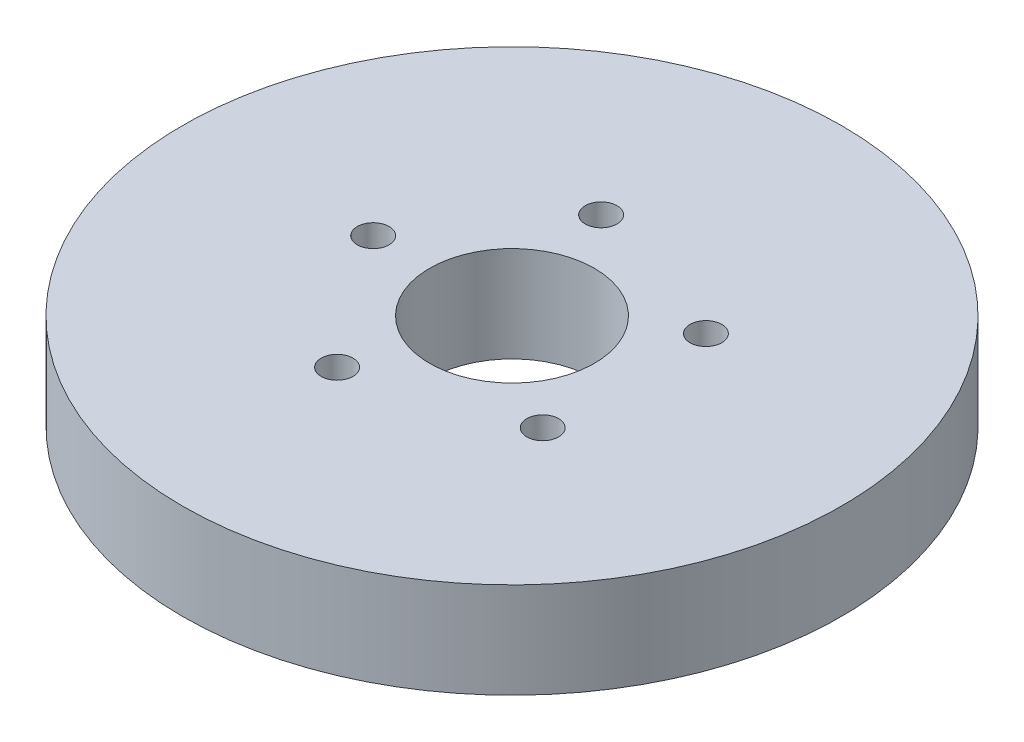
ISO-10303-21;
HEADER;
FILE_DESCRIPTION(('STEP AP214'),'2;1');
FILE_NAME('part.step','',(''),(''),'','','');
FILE_SCHEMA(('AUTOMOTIVE_DESIGN { 1 0 10303 214 1 1 1 1 }'));
ENDSEC;
DATA;
#1=APPLICATION_CONTEXT('core data for automotive mechanical design processes');
#2=APPLICATION_PROTOCOL_DEFINITION('international standard','automotive_design',2000,#1);
#3=PRODUCT_CONTEXT('',#1,'mechanical');
#4=PRODUCT('Part','Part','',(#3));
#5=PRODUCT_RELATED_PRODUCT_CATEGORY('part','',(#4));
#6=PRODUCT_DEFINITION_FORMATION('','',#4);
#7=PRODUCT_DEFINITION_CONTEXT('part definition',#1,'design');
#8=PRODUCT_DEFINITION('design','',#6,#7);
#9=PRODUCT_DEFINITION_SHAPE('','',#8);
#10=(LENGTH_UNIT() NAMED_UNIT(*) SI_UNIT(.MILLI.,.METRE.));
#11=(NAMED_UNIT(*) PLANE_ANGLE_UNIT() SI_UNIT($,.RADIAN.));
#12=(NAMED_UNIT(*) SI_UNIT($,.STERADIAN.) SOLID_ANGLE_UNIT());
#13=UNCERTAINTY_MEASURE_WITH_UNIT(LENGTH_MEASURE(1.E-05),#10,'distance_accuracy_value','');
#14=(GEOMETRIC_REPRESENTATION_CONTEXT(3) GLOBAL_UNCERTAINTY_ASSIGNED_CONTEXT((#13)) GLOBAL_UNIT_ASSIGNED_CONTEXT((#10,
#11,#12)) REPRESENTATION_CONTEXT('',''));
#15=CARTESIAN_POINT('',(0.,0.,0.));
#16=DIRECTION('',(0.,0.,1.));
#17=DIRECTION('',(1.,0.,0.));
#18=AXIS2_PLACEMENT_3D('',#15,#16,#17);
#19=CARTESIAN_POINT('',(0.,29.,0.));
#20=DIRECTION('',(0.,-1.,0.));
#21=DIRECTION('',(0.,0.,-1.));
#22=AXIS2_PLACEMENT_3D('',#19,#20,#21);
#23=CYLINDRICAL_SURFACE('',#22,100.);
#24=CARTESIAN_POINT('',(0.,29.,0.));
#25=DIRECTION('',(0.,1.,0.));
#26=DIRECTION('',(0.,0.,1.));
#27=AXIS2_PLACEMENT_3D('',#24,#25,#26);
#28=CIRCLE('',#27,100.);
#29=CARTESIAN_POINT('',(0.,29.,-100.));
#30=VERTEX_POINT('',#29);
#31=EDGE_CURVE('E10',#30,#30,#28,.T.);
#32=CARTESIAN_POINT('',(0.,0.,0.));
#33=DIRECTION('',(0.,1.,0.));
#34=DIRECTION('',(0.,0.,1.));
#35=AXIS2_PLACEMENT_3D('',#32,#33,#34);
#36=CIRCLE('',#35,100.);
#37=CARTESIAN_POINT('',(0.,0.,-100.));
#38=VERTEX_POINT('',#37);
#39=EDGE_CURVE('E37',#38,#38,#36,.T.);
#40=CARTESIAN_POINT('',(0.,29.,-100.));
#41=CARTESIAN_POINT('',(0.,28.6979166666667,-100.));
#42=CARTESIAN_POINT('',(0.,28.3958333333333,-100.));
#43=CARTESIAN_POINT('',(0.,27.7916666666667,-100.));
#44=CARTESIAN_POINT('',(0.,27.4895833333333,-100.));
#45=CARTESIAN_POINT('',(0.,26.8854166666667,-100.));
#46=CARTESIAN_POINT('',(0.,26.5833333333333,-100.));
#47=CARTESIAN_POINT('',(0.,25.9791666666667,-100.));
#48=CARTESIAN_POINT('',(0.,25.6770833333333,-100.));
#49=CARTESIAN_POINT('',(0.,25.0729166666667,-100.));
#50=CARTESIAN_POINT('',(0.,24.7708333333333,-100.));
#51=CARTESIAN_POINT('',(0.,24.1666666666667,-100.));
#52=CARTESIAN_POINT('',(0.,23.8645833333333,-100.));
#53=CARTESIAN_POINT('',(0.,23.2604166666667,-100.));
#54=CARTESIAN_POINT('',(0.,22.9583333333333,-100.));
#55=CARTESIAN_POINT('',(0.,22.3541666666667,-100.));
#56=CARTESIAN_POINT('',(0.,22.0520833333333,-100.));
#57=CARTESIAN_POINT('',(0.,21.4479166666667,-100.));
#58=CARTESIAN_POINT('',(0.,21.1458333333333,-100.));
#59=CARTESIAN_POINT('',(0.,20.5416666666667,-100.));
#60=CARTESIAN_POINT('',(0.,20.2395833333333,-100.));
#61=CARTESIAN_POINT('',(0.,19.6354166666667,-100.));
#62=CARTESIAN_POINT('',(0.,19.3333333333333,-100.));
#63=CARTESIAN_POINT('',(0.,18.7291666666667,-100.));
#64=CARTESIAN_POINT('',(0.,18.4270833333333,-100.));
#65=CARTESIAN_POINT('',(0.,17.8229166666667,-100.));
#66=CARTESIAN_POINT('',(0.,17.5208333333333,-100.));
#67=CARTESIAN_POINT('',(0.,16.9166666666667,-100.));
#68=CARTESIAN_POINT('',(0.,16.6145833333333,-100.));
#69=CARTESIAN_POINT('',(0.,16.0104166666667,-100.));
#70=CARTESIAN_POINT('',(0.,15.7083333333333,-100.));
#71=CARTESIAN_POINT('',(0.,15.1041666666667,-100.));
#72=CARTESIAN_POINT('',(0.,14.8020833333333,-100.));
#73=CARTESIAN_POINT('',(0.,14.1979166666667,-100.));
#74=CARTESIAN_POINT('',(0.,13.8958333333333,-100.));
#75=CARTESIAN_POINT('',(0.,13.2916666666667,-100.));
#76=CARTESIAN_POINT('',(0.,12.9895833333333,-100.));
#77=CARTESIAN_POINT('',(0.,12.3854166666667,-100.));
#78=CARTESIAN_POINT('',(0.,12.0833333333333,-100.));
#79=CARTESIAN_POINT('',(0.,11.4791666666667,-100.));
#80=CARTESIAN_POINT('',(0.,11.1770833333333,-100.));
#81=CARTESIAN_POINT('',(0.,10.5729166666667,-100.));
#82=CARTESIAN_POINT('',(0.,10.2708333333333,-100.));
#83=CARTESIAN_POINT('',(0.,9.66666666666667,-100.));
#84=CARTESIAN_POINT('',(0.,9.36458333333333,-100.));
#85=CARTESIAN_POINT('',(0.,8.76041666666667,-100.));
#86=CARTESIAN_POINT('',(0.,8.45833333333333,-100.));
#87=CARTESIAN_POINT('',(0.,7.85416666666667,-100.));
#88=CARTESIAN_POINT('',(0.,7.55208333333333,-100.));
#89=CARTESIAN_POINT('',(0.,6.94791666666667,-100.));
#90=CARTESIAN_POINT('',(0.,6.64583333333333,-100.));
#91=CARTESIAN_POINT('',(0.,6.04166666666667,-100.));
#92=CARTESIAN_POINT('',(0.,5.73958333333333,-100.));
#93=CARTESIAN_POINT('',(0.,5.13541666666667,-100.));
#94=CARTESIAN_POINT('',(0.,4.83333333333333,-100.));
#95=CARTESIAN_POINT('',(0.,4.22916666666667,-100.));
#96=CARTESIAN_POINT('',(0.,3.92708333333333,-100.));
#97=CARTESIAN_POINT('',(0.,3.32291666666667,-100.));
#98=CARTESIAN_POINT('',(0.,3.02083333333333,-100.));
#99=CARTESIAN_POINT('',(0.,2.41666666666667,-100.));
#100=CARTESIAN_POINT('',(0.,2.11458333333333,-100.));
#101=CARTESIAN_POINT('',(0.,1.51041666666667,-100.));
#102=CARTESIAN_POINT('',(0.,1.20833333333333,-100.));
#103=CARTESIAN_POINT('',(0.,0.604166666666667,-100.));
#104=CARTESIAN_POINT('',(0.,0.302083333333333,-100.));
#105=CARTESIAN_POINT('',(0.,0.,-100.));
#106=B_SPLINE_CURVE_WITH_KNOTS('',3,(#40,#41,#42,#43,#44,#45,#46,#47,#48,#49,#50,#51,#52,#53,
#54,#55,#56,#57,#58,#59,#60,#61,#62,#63,#64,#65,#66,#67,#68,#69,#70,#71,#72,#73,#74,#75,#76,#77,
#78,#79,#80,#81,#82,#83,#84,#85,#86,#87,#88,#89,#90,#91,#92,#93,#94,#95,#96,#97,#98,#99,#100,
#101,#102,#103,#104,#105),.UNSPECIFIED.,.F.,.F.,(4,2,2,2,2,2,2,2,2,2,2,2,2,2,2,2,2,2,2,2,2,2,2,
2,2,2,2,2,2,2,2,2,4),(0.,0.906249999999997,1.8125,2.71875,3.625,4.53125,5.4375,6.34375,7.25,
8.15625,9.0625,9.96875,10.875,11.78125,12.6875,13.59375,14.5,15.40625,16.3125,17.21875,18.125,
19.03125,19.9375,20.84375,21.75,22.65625,23.5625,24.46875,25.375,26.28125,27.1875,28.09375,29.),.UNSPECIFIED.);
#107=EDGE_CURVE('BSEAM40',#30,#38,#106,.T.);
#108=ORIENTED_EDGE('',*,*,#31,.F.);
#109=ORIENTED_EDGE('',*,*,#39,.T.);
#110=ORIENTED_EDGE('',*,*,#107,.T.);
#111=ORIENTED_EDGE('',*,*,#107,.F.);
#112=EDGE_LOOP('',(#108,#110,#109,#111));
#113=FACE_BOUND('',#112,.T.);
#114=ADVANCED_FACE('F40',(#113),#23,.T.);
#115=CARTESIAN_POINT('',(0.,29.,0.));
#116=DIRECTION('',(0.,1.,0.));
#117=DIRECTION('',(0.,0.,1.));
#118=AXIS2_PLACEMENT_3D('',#115,#116,#117);
#119=PLANE('',#118);
#120=CARTESIAN_POINT('',(-13.0169185378504,29.,40.0619558886939));
#121=DIRECTION('',(0.,1.,0.));
#122=DIRECTION('',(0.951056516295155,0.,0.309016994374945));
#123=AXIS2_PLACEMENT_3D('',#120,#121,#122);
#124=CIRCLE('',#123,4.82524539026493);
#125=CARTESIAN_POINT('',(-8.42783746671577,29.,41.5530387163151));
#126=VERTEX_POINT('',#125);
#127=EDGE_CURVE('E78',#126,#126,#124,.T.);
#128=ORIENTED_EDGE('',*,*,#127,.F.);
#129=EDGE_LOOP('',(#128));
#130=FACE_BOUND('',#129,.T.);
#131=CARTESIAN_POINT('',(34.0787351608813,29.,24.7596503950116));
#132=DIRECTION('',(0.,1.,0.));
#133=DIRECTION('',(0.587785252292469,0.,-0.809016994374951));
#134=AXIS2_PLACEMENT_3D('',#131,#132,#133);
#135=CIRCLE('',#134,4.82524539026493);
#136=CARTESIAN_POINT('',(36.9149432399713,29.,20.8559448722579));
#137=VERTEX_POINT('',#136);
#138=EDGE_CURVE('E71',#137,#137,#135,.T.);
#139=ORIENTED_EDGE('',*,*,#138,.F.);
#140=EDGE_LOOP('',(#139));
#141=FACE_BOUND('',#140,.T.);
#142=CARTESIAN_POINT('',(34.078735160881,29.,-24.7596503950121));
#143=DIRECTION('',(0.,1.,0.));
#144=DIRECTION('',(-0.58778525229248,0.,-0.809016994374942));
#145=AXIS2_PLACEMENT_3D('',#142,#143,#144);
#146=CIRCLE('',#145,4.82524539026493);
#147=CARTESIAN_POINT('',(31.242527081791,29.,-28.6633559177658));
#148=VERTEX_POINT('',#147);
#149=EDGE_CURVE('E70',#148,#148,#146,.T.);
#150=ORIENTED_EDGE('',*,*,#149,.F.);
#151=EDGE_LOOP('',(#150));
#152=FACE_BOUND('',#151,.T.);
#153=CARTESIAN_POINT('',(-13.016918537851,29.,-40.0619558886937));
#154=DIRECTION('',(0.,1.,0.));
#155=DIRECTION('',(-0.95105651629515,0.,0.309016994374958));
#156=AXIS2_PLACEMENT_3D('',#153,#154,#155);
#157=CIRCLE('',#156,4.82524539026493);
#158=CARTESIAN_POINT('',(-17.6059996089855,29.,-38.5708730610724));
#159=VERTEX_POINT('',#158);
#160=EDGE_CURVE('E61',#159,#159,#157,.T.);
#161=ORIENTED_EDGE('',*,*,#160,.F.);
#162=EDGE_LOOP('',(#161));
#163=FACE_BOUND('',#162,.T.);
#164=CARTESIAN_POINT('',(-42.1236332460614,29.,0.));
#165=DIRECTION('',(0.,1.,0.));
#166=DIRECTION('',(0.,0.,1.));
#167=AXIS2_PLACEMENT_3D('',#164,#165,#166);
#168=CIRCLE('',#167,4.82524539026493);
#169=CARTESIAN_POINT('',(-42.1236332460614,29.,4.82524539026493));
#170=VERTEX_POINT('',#169);
#171=EDGE_CURVE('E54',#170,#170,#168,.T.);
#172=ORIENTED_EDGE('',*,*,#171,.F.);
#173=EDGE_LOOP('',(#172));
#174=FACE_BOUND('',#173,.T.);
#175=CARTESIAN_POINT('',(0.,29.,0.));
#176=DIRECTION('',(0.,1.,0.));
#177=DIRECTION('',(0.,0.,1.));
#178=AXIS2_PLACEMENT_3D('',#175,#176,#177);
#179=CIRCLE('',#178,25.);
#180=CARTESIAN_POINT('',(0.,29.,-25.));
#181=VERTEX_POINT('',#180);
#182=EDGE_CURVE('E50',#181,#181,#179,.T.);
#183=ORIENTED_EDGE('',*,*,#182,.F.);
#184=EDGE_LOOP('',(#183));
#185=FACE_BOUND('',#184,.T.);
#186=ORIENTED_EDGE('',*,*,#31,.T.);
#187=EDGE_LOOP('',(#186));
#188=FACE_BOUND('',#187,.T.);
#189=ADVANCED_FACE('F94',(#130,#141,#152,#163,#174,#185,#188),#119,.T.);
#190=CARTESIAN_POINT('',(0.,0.,0.));
#191=DIRECTION('',(0.,1.,0.));
#192=DIRECTION('',(0.,0.,1.));
#193=AXIS2_PLACEMENT_3D('',#190,#191,#192);
#194=PLANE('',#193);
#195=CARTESIAN_POINT('',(0.,0.,0.));
#196=DIRECTION('',(0.,1.,0.));
#197=DIRECTION('',(0.,0.,1.));
#198=AXIS2_PLACEMENT_3D('',#195,#196,#197);
#199=CIRCLE('',#198,25.);
#200=CARTESIAN_POINT('',(0.,0.,-25.));
#201=VERTEX_POINT('',#200);
#202=EDGE_CURVE('E47',#201,#201,#199,.T.);
#203=ORIENTED_EDGE('',*,*,#202,.T.);
#204=EDGE_LOOP('',(#203));
#205=FACE_BOUND('',#204,.T.);
#206=ORIENTED_EDGE('',*,*,#39,.F.);
#207=EDGE_LOOP('',(#206));
#208=FACE_BOUND('',#207,.T.);
#209=ADVANCED_FACE('F100',(#205,#208),#194,.F.);
#210=CARTESIAN_POINT('',(0.,29.,0.));
#211=DIRECTION('',(0.,-1.,0.));
#212=DIRECTION('',(0.,0.,-1.));
#213=AXIS2_PLACEMENT_3D('',#210,#211,#212);
#214=CYLINDRICAL_SURFACE('',#213,25.);
#215=CARTESIAN_POINT('',(0.,29.,-25.));
#216=CARTESIAN_POINT('',(0.,28.6979166666667,-25.));
#217=CARTESIAN_POINT('',(0.,28.3958333333333,-25.));
#218=CARTESIAN_POINT('',(0.,27.7916666666667,-25.));
#219=CARTESIAN_POINT('',(0.,27.4895833333333,-25.));
#220=CARTESIAN_POINT('',(0.,26.8854166666667,-25.));
#221=CARTESIAN_POINT('',(0.,26.5833333333333,-25.));
#222=CARTESIAN_POINT('',(0.,25.9791666666667,-25.));
#223=CARTESIAN_POINT('',(0.,25.6770833333333,-25.));
#224=CARTESIAN_POINT('',(0.,25.0729166666667,-25.));
#225=CARTESIAN_POINT('',(0.,24.7708333333333,-25.));
#226=CARTESIAN_POINT('',(0.,24.1666666666667,-25.));
#227=CARTESIAN_POINT('',(0.,23.8645833333333,-25.));
#228=CARTESIAN_POINT('',(0.,23.2604166666667,-25.));
#229=CARTESIAN_POINT('',(0.,22.9583333333333,-25.));
#230=CARTESIAN_POINT('',(0.,22.3541666666667,-25.));
#231=CARTESIAN_POINT('',(0.,22.0520833333333,-25.));
#232=CARTESIAN_POINT('',(0.,21.4479166666667,-25.));
#233=CARTESIAN_POINT('',(0.,21.1458333333333,-25.));
#234=CARTESIAN_POINT('',(0.,20.5416666666667,-25.));
#235=CARTESIAN_POINT('',(0.,20.2395833333333,-25.));
#236=CARTESIAN_POINT('',(0.,19.6354166666667,-25.));
#237=CARTESIAN_POINT('',(0.,19.3333333333333,-25.));
#238=CARTESIAN_POINT('',(0.,18.7291666666667,-25.));
#239=CARTESIAN_POINT('',(0.,18.4270833333333,-25.));
#240=CARTESIAN_POINT('',(0.,17.8229166666667,-25.));
#241=CARTESIAN_POINT('',(0.,17.5208333333333,-25.));
#242=CARTESIAN_POINT('',(0.,16.9166666666667,-25.));
#243=CARTESIAN_POINT('',(0.,16.6145833333333,-25.));
#244=CARTESIAN_POINT('',(0.,16.0104166666667,-25.));
#245=CARTESIAN_POINT('',(0.,15.7083333333333,-25.));
#246=CARTESIAN_POINT('',(0.,15.1041666666667,-25.));
#247=CARTESIAN_POINT('',(0.,14.8020833333333,-25.));
#248=CARTESIAN_POINT('',(0.,14.1979166666667,-25.));
#249=CARTESIAN_POINT('',(0.,13.8958333333333,-25.));
#250=CARTESIAN_POINT('',(0.,13.2916666666667,-25.));
#251=CARTESIAN_POINT('',(0.,12.9895833333333,-25.));
#252=CARTESIAN_POINT('',(0.,12.3854166666667,-25.));
#253=CARTESIAN_POINT('',(0.,12.0833333333333,-25.));
#254=CARTESIAN_POINT('',(0.,11.4791666666667,-25.));
#255=CARTESIAN_POINT('',(0.,11.1770833333333,-25.));
#256=CARTESIAN_POINT('',(0.,10.5729166666667,-25.));
#257=CARTESIAN_POINT('',(0.,10.2708333333333,-25.));
#258=CARTESIAN_POINT('',(0.,9.66666666666667,-25.));
#259=CARTESIAN_POINT('',(0.,9.36458333333333,-25.));
#260=CARTESIAN_POINT('',(0.,8.76041666666667,-25.));
#261=CARTESIAN_POINT('',(0.,8.45833333333333,-25.));
#262=CARTESIAN_POINT('',(0.,7.85416666666667,-25.));
#263=CARTESIAN_POINT('',(0.,7.55208333333333,-25.));
#264=CARTESIAN_POINT('',(0.,6.94791666666667,-25.));
#265=CARTESIAN_POINT('',(0.,6.64583333333333,-25.));
#266=CARTESIAN_POINT('',(0.,6.04166666666667,-25.));
#267=CARTESIAN_POINT('',(0.,5.73958333333333,-25.));
#268=CARTESIAN_POINT('',(0.,5.13541666666667,-25.));
#269=CARTESIAN_POINT('',(0.,4.83333333333333,-25.));
#270=CARTESIAN_POINT('',(0.,4.22916666666667,-25.));
#271=CARTESIAN_POINT('',(0.,3.92708333333333,-25.));
#272=CARTESIAN_POINT('',(0.,3.32291666666667,-25.));
#273=CARTESIAN_POINT('',(0.,3.02083333333333,-25.));
#274=CARTESIAN_POINT('',(0.,2.41666666666667,-25.));
#275=CARTESIAN_POINT('',(0.,2.11458333333333,-25.));
#276=CARTESIAN_POINT('',(0.,1.51041666666667,-25.));
#277=CARTESIAN_POINT('',(0.,1.20833333333333,-25.));
#278=CARTESIAN_POINT('',(0.,0.604166666666667,-25.));
#279=CARTESIAN_POINT('',(0.,0.302083333333333,-25.));
#280=CARTESIAN_POINT('',(0.,0.,-25.));
#281=B_SPLINE_CURVE_WITH_KNOTS('',3,(#215,#216,#217,#218,#219,#220,#221,#222,#223,#224,#225,
#226,#227,#228,#229,#230,#231,#232,#233,#234,#235,#236,#237,#238,#239,#240,#241,#242,#243,#244,
#245,#246,#247,#248,#249,#250,#251,#252,#253,#254,#255,#256,#257,#258,#259,#260,#261,#262,#263,
#264,#265,#266,#267,#268,#269,#270,#271,#272,#273,#274,#275,#276,#277,#278,#279,#280),
.UNSPECIFIED.,.F.,.F.,(4,2,2,2,2,2,2,2,2,2,2,2,2,2,2,2,2,2,2,2,2,2,2,2,2,2,2,2,2,2,2,2,4),(0.,
0.906249999999997,1.8125,2.71875,3.625,4.53125,5.4375,6.34375,7.25,8.15625,9.0625,9.96875,
10.875,11.78125,12.6875,13.59375,14.5,15.40625,16.3125,17.21875,18.125,19.03125,19.9375,
20.84375,21.75,22.65625,23.5625,24.46875,25.375,26.28125,27.1875,28.09375,29.),.UNSPECIFIED.);
#282=EDGE_CURVE('BSEAM108',#181,#201,#281,.T.);
#283=ORIENTED_EDGE('',*,*,#182,.T.);
#284=ORIENTED_EDGE('',*,*,#202,.F.);
#285=ORIENTED_EDGE('',*,*,#282,.T.);
#286=ORIENTED_EDGE('',*,*,#282,.F.);
#287=EDGE_LOOP('',(#283,#285,#284,#286));
#288=FACE_BOUND('',#287,.T.);
#289=ADVANCED_FACE('F108',(#288),#214,.F.);
#290=CARTESIAN_POINT('',(-42.1236332460614,11.0987074401823,0.));
#291=DIRECTION('',(0.,1.,0.));
#292=DIRECTION('',(0.,0.,1.));
#293=AXIS2_PLACEMENT_3D('',#290,#291,#292);
#294=CYLINDRICAL_SURFACE('',#293,4.82524539026493);
#295=CARTESIAN_POINT('',(-42.1236332460614,11.0987074401823,0.));
#296=DIRECTION('',(0.,1.,0.));
#297=DIRECTION('',(0.,0.,1.));
#298=AXIS2_PLACEMENT_3D('',#295,#296,#297);
#299=CIRCLE('',#298,4.82524539026493);
#300=CARTESIAN_POINT('',(-42.1236332460614,11.0987074401823,4.82524539026493));
#301=VERTEX_POINT('',#300);
#302=EDGE_CURVE('E55',#301,#301,#299,.T.);
#303=ORIENTED_EDGE('',*,*,#302,.F.);
#304=EDGE_LOOP('',(#303));
#305=FACE_BOUND('',#304,.T.);
#306=ORIENTED_EDGE('',*,*,#171,.T.);
#307=EDGE_LOOP('',(#306));
#308=FACE_BOUND('',#307,.T.);
#309=ADVANCED_FACE('F115',(#305,#308),#294,.F.);
#310=CARTESIAN_POINT('',(-42.1236332460614,11.0987074401823,0.));
#311=DIRECTION('',(0.,1.,0.));
#312=DIRECTION('',(0.,0.,1.));
#313=AXIS2_PLACEMENT_3D('',#310,#311,#312);
#314=PLANE('',#313);
#315=ORIENTED_EDGE('',*,*,#302,.T.);
#316=EDGE_LOOP('',(#315));
#317=FACE_BOUND('',#316,.T.);
#318=ADVANCED_FACE('F142',(#317),#314,.T.);
#319=CARTESIAN_POINT('',(-13.016918537851,11.0987074401823,-40.0619558886937));
#320=DIRECTION('',(0.,1.,0.));
#321=DIRECTION('',(0.,0.,1.));
#322=AXIS2_PLACEMENT_3D('',#319,#320,#321);
#323=CYLINDRICAL_SURFACE('',#322,4.82524539026493);
#324=CARTESIAN_POINT('',(-13.016918537851,11.0987074401823,-40.0619558886937));
#325=DIRECTION('',(0.,1.,0.));
#326=DIRECTION('',(-0.95105651629515,0.,0.309016994374958));
#327=AXIS2_PLACEMENT_3D('',#324,#325,#326);
#328=CIRCLE('',#327,4.82524539026493);
#329=CARTESIAN_POINT('',(-17.6059996089855,11.0987074401823,-38.5708730610724));
#330=VERTEX_POINT('',#329);
#331=EDGE_CURVE('E63',#330,#330,#328,.T.);
#332=ORIENTED_EDGE('',*,*,#331,.F.);
#333=EDGE_LOOP('',(#332));
#334=FACE_BOUND('',#333,.T.);
#335=ORIENTED_EDGE('',*,*,#160,.T.);
#336=EDGE_LOOP('',(#335));
#337=FACE_BOUND('',#336,.T.);
#338=ADVANCED_FACE('F147',(#334,#337),#323,.F.);
#339=CARTESIAN_POINT('',(-13.016918537851,11.0987074401823,-40.0619558886937));
#340=DIRECTION('',(0.,1.,0.));
#341=DIRECTION('',(-0.95105651629515,0.,0.309016994374958));
#342=AXIS2_PLACEMENT_3D('',#339,#340,#341);
#343=PLANE('',#342);
#344=ORIENTED_EDGE('',*,*,#331,.T.);
#345=EDGE_LOOP('',(#344));
#346=FACE_BOUND('',#345,.T.);
#347=ADVANCED_FACE('F163',(#346),#343,.T.);
#348=CARTESIAN_POINT('',(34.078735160881,11.0987074401823,-24.7596503950121));
#349=DIRECTION('',(0.,1.,0.));
#350=DIRECTION('',(0.,0.,1.));
#351=AXIS2_PLACEMENT_3D('',#348,#349,#350);
#352=CYLINDRICAL_SURFACE('',#351,4.82524539026493);
#353=CARTESIAN_POINT('',(34.078735160881,11.0987074401823,-24.7596503950121));
#354=DIRECTION('',(0.,1.,0.));
#355=DIRECTION('',(-0.58778525229248,0.,-0.809016994374942));
#356=AXIS2_PLACEMENT_3D('',#353,#354,#355);
#357=CIRCLE('',#356,4.82524539026493);
#358=CARTESIAN_POINT('',(31.242527081791,11.0987074401823,-28.6633559177658));
#359=VERTEX_POINT('',#358);
#360=EDGE_CURVE('E69',#359,#359,#357,.T.);
#361=ORIENTED_EDGE('',*,*,#360,.F.);
#362=EDGE_LOOP('',(#361));
#363=FACE_BOUND('',#362,.T.);
#364=ORIENTED_EDGE('',*,*,#149,.T.);
#365=EDGE_LOOP('',(#364));
#366=FACE_BOUND('',#365,.T.);
#367=ADVANCED_FACE('F172',(#363,#366),#352,.F.);
#368=CARTESIAN_POINT('',(34.078735160881,11.0987074401823,-24.7596503950121));
#369=DIRECTION('',(0.,1.,0.));
#370=DIRECTION('',(-0.58778525229248,0.,-0.809016994374942));
#371=AXIS2_PLACEMENT_3D('',#368,#369,#370);
#372=PLANE('',#371);
#373=ORIENTED_EDGE('',*,*,#360,.T.);
#374=EDGE_LOOP('',(#373));
#375=FACE_BOUND('',#374,.T.);
#376=ADVANCED_FACE('F185',(#375),#372,.T.);
#377=CARTESIAN_POINT('',(34.0787351608813,11.0987074401823,24.7596503950116));
#378=DIRECTION('',(0.,1.,0.));
#379=DIRECTION('',(0.,0.,1.));
#380=AXIS2_PLACEMENT_3D('',#377,#378,#379);
#381=CYLINDRICAL_SURFACE('',#380,4.82524539026493);
#382=CARTESIAN_POINT('',(34.0787351608813,11.0987074401823,24.7596503950116));
#383=DIRECTION('',(0.,1.,0.));
#384=DIRECTION('',(0.587785252292469,0.,-0.809016994374951));
#385=AXIS2_PLACEMENT_3D('',#382,#383,#384);
#386=CIRCLE('',#385,4.82524539026493);
#387=CARTESIAN_POINT('',(36.9149432399713,11.0987074401823,20.8559448722579));
#388=VERTEX_POINT('',#387);
#389=EDGE_CURVE('E76',#388,#388,#386,.T.);
#390=ORIENTED_EDGE('',*,*,#389,.F.);
#391=EDGE_LOOP('',(#390));
#392=FACE_BOUND('',#391,.T.);
#393=ORIENTED_EDGE('',*,*,#138,.T.);
#394=EDGE_LOOP('',(#393));
#395=FACE_BOUND('',#394,.T.);
#396=ADVANCED_FACE('F191',(#392,#395),#381,.F.);
#397=CARTESIAN_POINT('',(34.0787351608813,11.0987074401823,24.7596503950116));
#398=DIRECTION('',(0.,1.,0.));
#399=DIRECTION('',(0.587785252292469,0.,-0.809016994374951));
#400=AXIS2_PLACEMENT_3D('',#397,#398,#399);
#401=PLANE('',#400);
#402=ORIENTED_EDGE('',*,*,#389,.T.);
#403=EDGE_LOOP('',(#402));
#404=FACE_BOUND('',#403,.T.);
#405=ADVANCED_FACE('F89',(#404),#401,.T.);
#406=CARTESIAN_POINT('',(-13.0169185378504,11.0987074401823,40.0619558886939));
#407=DIRECTION('',(0.,1.,0.));
#408=DIRECTION('',(0.,0.,1.));
#409=AXIS2_PLACEMENT_3D('',#406,#407,#408);
#410=CYLINDRICAL_SURFACE('',#409,4.82524539026493);
#411=CARTESIAN_POINT('',(-13.0169185378504,11.0987074401823,40.0619558886939));
#412=DIRECTION('',(0.,1.,0.));
#413=DIRECTION('',(0.951056516295155,0.,0.309016994374945));
#414=AXIS2_PLACEMENT_3D('',#411,#412,#413);
#415=CIRCLE('',#414,4.82524539026493);
#416=CARTESIAN_POINT('',(-8.42783746671577,11.0987074401823,41.5530387163151));
#417=VERTEX_POINT('',#416);
#418=EDGE_CURVE('E59',#417,#417,#415,.T.);
#419=ORIENTED_EDGE('',*,*,#418,.F.);
#420=EDGE_LOOP('',(#419));
#421=FACE_BOUND('',#420,.T.);
#422=ORIENTED_EDGE('',*,*,#127,.T.);
#423=EDGE_LOOP('',(#422));
#424=FACE_BOUND('',#423,.T.);
#425=ADVANCED_FACE('F87',(#421,#424),#410,.F.);
#426=CARTESIAN_POINT('',(-13.0169185378504,11.0987074401823,40.0619558886939));
#427=DIRECTION('',(0.,1.,0.));
#428=DIRECTION('',(0.951056516295155,0.,0.309016994374945));
#429=AXIS2_PLACEMENT_3D('',#426,#427,#428);
#430=PLANE('',#429);
#431=ORIENTED_EDGE('',*,*,#418,.T.);
#432=EDGE_LOOP('',(#431));
#433=FACE_BOUND('',#432,.T.);
#434=ADVANCED_FACE('F84',(#433),#430,.T.);
#435=CLOSED_SHELL('',(#114,#189,#209,#289,#309,#318,#338,#347,#367,#376,#396,#405,#425,#434));
#436=MANIFOLD_SOLID_BREP('B2',#435);
#437=ADVANCED_BREP_SHAPE_REPRESENTATION('',(#18,#436),#14);
#438=SHAPE_DEFINITION_REPRESENTATION(#9,#437);
ENDSEC;
END-ISO-10303-21;
